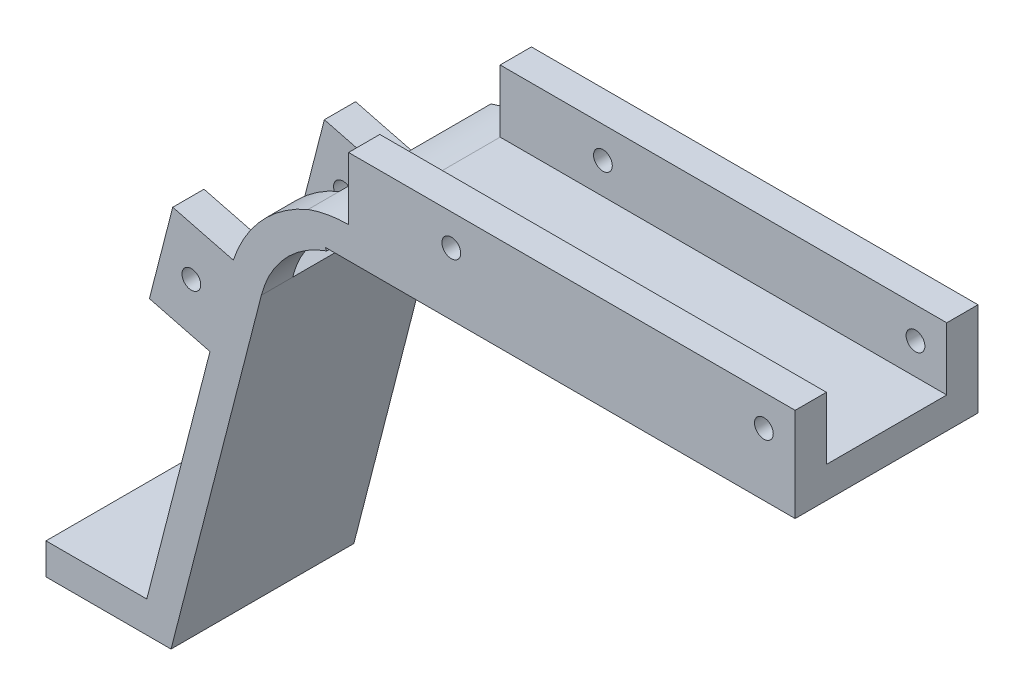
ISO-10303-21;
HEADER;
FILE_DESCRIPTION(('STEP AP214'),'2;1');
FILE_NAME('part.step','',(''),(''),'','','');
FILE_SCHEMA(('AUTOMOTIVE_DESIGN { 1 0 10303 214 1 1 1 1 }'));
ENDSEC;
DATA;
#1=APPLICATION_CONTEXT('core data for automotive mechanical design processes');
#2=APPLICATION_PROTOCOL_DEFINITION('international standard','automotive_design',2000,#1);
#3=PRODUCT_CONTEXT('',#1,'mechanical');
#4=PRODUCT('Part','Part','',(#3));
#5=PRODUCT_RELATED_PRODUCT_CATEGORY('part','',(#4));
#6=PRODUCT_DEFINITION_FORMATION('','',#4);
#7=PRODUCT_DEFINITION_CONTEXT('part definition',#1,'design');
#8=PRODUCT_DEFINITION('design','',#6,#7);
#9=PRODUCT_DEFINITION_SHAPE('','',#8);
#10=(LENGTH_UNIT() NAMED_UNIT(*) SI_UNIT(.MILLI.,.METRE.));
#11=(NAMED_UNIT(*) PLANE_ANGLE_UNIT() SI_UNIT($,.RADIAN.));
#12=(NAMED_UNIT(*) SI_UNIT($,.STERADIAN.) SOLID_ANGLE_UNIT());
#13=UNCERTAINTY_MEASURE_WITH_UNIT(LENGTH_MEASURE(1.E-05),#10,'distance_accuracy_value','');
#14=(GEOMETRIC_REPRESENTATION_CONTEXT(3) GLOBAL_UNCERTAINTY_ASSIGNED_CONTEXT((#13)) GLOBAL_UNIT_ASSIGNED_CONTEXT((#10,
#11,#12)) REPRESENTATION_CONTEXT('',''));
#15=CARTESIAN_POINT('',(0.,0.,0.));
#16=DIRECTION('',(0.,0.,1.));
#17=DIRECTION('',(1.,0.,0.));
#18=AXIS2_PLACEMENT_3D('',#15,#16,#17);
#19=CARTESIAN_POINT('',(30.0716443930858,58.6603082817505,-5.));
#20=DIRECTION('',(0.968542433750036,-0.248848455943689,0.));
#21=DIRECTION('',(0.248848455943689,0.968542433750036,0.));
#22=AXIS2_PLACEMENT_3D('',#19,#20,#21);
#23=PLANE('',#22);
#24=DIRECTION('',(0.,0.,1.));
#25=VECTOR('',#24,1.);
#26=CARTESIAN_POINT('',(26.3912089750386,44.3356950807672,-29.25));
#27=LINE('',#26,#25);
#28=CARTESIAN_POINT('',(26.3912089750386,44.3356950807672,-29.25));
#29=VERTEX_POINT('',#28);
#30=CARTESIAN_POINT('',(26.3912089750386,44.3356950807672,-24.25));
#31=VERTEX_POINT('',#30);
#32=EDGE_CURVE('E845',#29,#31,#27,.T.);
#33=ORIENTED_EDGE('',*,*,#32,.F.);
#34=DIRECTION('',(0.248848455943689,0.968542433750035,0.));
#35=VECTOR('',#34,1.);
#36=CARTESIAN_POINT('',(15.,0.,-29.25));
#37=LINE('',#36,#35);
#38=CARTESIAN_POINT('',(16.2846543799851,5.,-29.25));
#39=VERTEX_POINT('',#38);
#40=EDGE_CURVE('E235',#39,#29,#37,.T.);
#41=ORIENTED_EDGE('',*,*,#40,.F.);
#42=DIRECTION('',(0.,0.,1.));
#43=VECTOR('',#42,1.);
#44=CARTESIAN_POINT('',(16.2846543799851,5.,-5.));
#45=LINE('',#44,#43);
#46=CARTESIAN_POINT('',(16.2846543799851,5.,0.));
#47=VERTEX_POINT('',#46);
#48=EDGE_CURVE('E386',#39,#47,#45,.T.);
#49=ORIENTED_EDGE('',*,*,#48,.T.);
#50=DIRECTION('',(0.248848455943689,0.968542433750035,0.));
#51=VECTOR('',#50,1.);
#52=CARTESIAN_POINT('',(15.,0.,0.));
#53=LINE('',#52,#51);
#54=CARTESIAN_POINT('',(26.3912089750386,44.3356950807672,0.));
#55=VERTEX_POINT('',#54);
#56=EDGE_CURVE('E401',#47,#55,#53,.T.);
#57=ORIENTED_EDGE('',*,*,#56,.T.);
#58=DIRECTION('',(0.,0.,1.));
#59=VECTOR('',#58,1.);
#60=CARTESIAN_POINT('',(26.3912089750386,44.3356950807672,-5.));
#61=LINE('',#60,#59);
#62=CARTESIAN_POINT('',(26.3912089750386,44.3356950807672,-5.));
#63=VERTEX_POINT('',#62);
#64=EDGE_CURVE('E49',#63,#55,#61,.T.);
#65=ORIENTED_EDGE('',*,*,#64,.F.);
#66=DIRECTION('',(-0.248848455943689,-0.968542433750035,0.));
#67=VECTOR('',#66,1.);
#68=CARTESIAN_POINT('',(30.1238545546568,58.8635153169826,-5.));
#69=LINE('',#68,#67);
#70=CARTESIAN_POINT('',(30.1238545546567,58.8635153169826,-5.));
#71=VERTEX_POINT('',#70);
#72=EDGE_CURVE('E54',#71,#63,#69,.T.);
#73=ORIENTED_EDGE('',*,*,#72,.F.);
#74=DIRECTION('',(0.,0.,-1.));
#75=VECTOR('',#74,1.);
#76=CARTESIAN_POINT('',(30.1238545546568,58.8635153169826,-5.));
#77=LINE('',#76,#75);
#78=CARTESIAN_POINT('',(30.1238545546568,58.8635153169826,0.));
#79=VERTEX_POINT('',#78);
#80=EDGE_CURVE('E246',#79,#71,#77,.T.);
#81=ORIENTED_EDGE('',*,*,#80,.F.);
#82=CARTESIAN_POINT('',(30.1239358141939,58.8638315870177,0.));
#83=VERTEX_POINT('',#82);
#84=EDGE_CURVE('E390',#79,#83,#53,.T.);
#85=ORIENTED_EDGE('',*,*,#84,.T.);
#86=DIRECTION('',(0.,0.,1.));
#87=VECTOR('',#86,1.);
#88=CARTESIAN_POINT('',(30.1239358141939,58.8638315870177,-29.25));
#89=LINE('',#88,#87);
#90=CARTESIAN_POINT('',(30.1239358141939,58.8638315870177,-24.25));
#91=VERTEX_POINT('',#90);
#92=EDGE_CURVE('E413',#91,#83,#89,.T.);
#93=ORIENTED_EDGE('',*,*,#92,.F.);
#94=DIRECTION('',(0.248848455943689,0.968542433750036,0.));
#95=VECTOR('',#94,1.);
#96=CARTESIAN_POINT('',(30.1239358141939,58.8638315870177,-24.25));
#97=LINE('',#96,#95);
#98=EDGE_CURVE('E230',#31,#91,#97,.T.);
#99=ORIENTED_EDGE('',*,*,#98,.F.);
#100=EDGE_LOOP('',(#33,#41,#49,#57,#65,#73,#81,#85,#93,#99));
#101=FACE_BOUND('',#100,.T.);
#102=ADVANCED_FACE('F32',(#101),#23,.F.);
#103=CARTESIAN_POINT('',(120.,73.,-5.));
#104=DIRECTION('',(0.,-1.,0.));
#105=DIRECTION('',(1.,0.,0.));
#106=AXIS2_PLACEMENT_3D('',#103,#104,#105);
#107=PLANE('',#106);
#108=DIRECTION('',(1.,0.,0.));
#109=VECTOR('',#108,1.);
#110=CARTESIAN_POINT('',(48.5613886077065,73.,-24.25));
#111=LINE('',#110,#109);
#112=CARTESIAN_POINT('',(48.5613886077065,73.,-24.25));
#113=VERTEX_POINT('',#112);
#114=CARTESIAN_POINT('',(120.,73.,-24.25));
#115=VERTEX_POINT('',#114);
#116=EDGE_CURVE('E285',#113,#115,#111,.T.);
#117=ORIENTED_EDGE('',*,*,#116,.F.);
#118=DIRECTION('',(0.,0.,1.));
#119=VECTOR('',#118,1.);
#120=CARTESIAN_POINT('',(48.5613886077065,73.,-5.));
#121=LINE('',#120,#119);
#122=CARTESIAN_POINT('',(48.5613886077065,73.,-5.));
#123=VERTEX_POINT('',#122);
#124=EDGE_CURVE('E439',#113,#123,#121,.T.);
#125=ORIENTED_EDGE('',*,*,#124,.T.);
#126=DIRECTION('',(-1.,0.,0.));
#127=VECTOR('',#126,1.);
#128=CARTESIAN_POINT('',(48.5613886077065,73.,-5.));
#129=LINE('',#128,#127);
#130=CARTESIAN_POINT('',(120.,73.,-5.));
#131=VERTEX_POINT('',#130);
#132=EDGE_CURVE('E309',#131,#123,#129,.T.);
#133=ORIENTED_EDGE('',*,*,#132,.F.);
#134=DIRECTION('',(0.,0.,1.));
#135=VECTOR('',#134,1.);
#136=CARTESIAN_POINT('',(120.,73.,-5.));
#137=LINE('',#136,#135);
#138=EDGE_CURVE('E11',#115,#131,#137,.T.);
#139=ORIENTED_EDGE('',*,*,#138,.F.);
#140=EDGE_LOOP('',(#117,#125,#133,#139));
#141=FACE_BOUND('',#140,.T.);
#142=ADVANCED_FACE('F471',(#141),#107,.F.);
#143=CARTESIAN_POINT('',(44.7991427530738,68.,-29.25));
#144=DIRECTION('',(0.819152044288991,0.573576436351047,0.));
#145=DIRECTION('',(-0.573576436351047,0.819152044288991,0.));
#146=AXIS2_PLACEMENT_3D('',#143,#144,#145);
#147=PLANE('',#146);
#148=DIRECTION('',(0.573576436351047,-0.819152044288991,0.));
#149=VECTOR('',#148,1.);
#150=CARTESIAN_POINT('',(45.0696556216259,67.6136675859792,-5.));
#151=LINE('',#150,#149);
#152=CARTESIAN_POINT('',(42.0896554210916,71.8695489324633,-5.));
#153=VERTEX_POINT('',#152);
#154=CARTESIAN_POINT('',(44.7991427530738,68.,-5.));
#155=VERTEX_POINT('',#154);
#156=EDGE_CURVE('E356',#153,#155,#151,.T.);
#157=ORIENTED_EDGE('',*,*,#156,.F.);
#158=DIRECTION('',(0.,0.,1.));
#159=VECTOR('',#158,1.);
#160=CARTESIAN_POINT('',(42.0896554210916,71.8695489324633,-29.25));
#161=LINE('',#160,#159);
#162=CARTESIAN_POINT('',(42.0896554210916,71.8695489324633,-29.25));
#163=VERTEX_POINT('',#162);
#164=EDGE_CURVE('E428',#163,#153,#161,.T.);
#165=ORIENTED_EDGE('',*,*,#164,.F.);
#166=DIRECTION('',(-0.573576436351047,0.819152044288991,0.));
#167=VECTOR('',#166,1.);
#168=CARTESIAN_POINT('',(44.7991427530738,68.,-29.25));
#169=LINE('',#168,#167);
#170=CARTESIAN_POINT('',(44.7991427530738,68.,-29.25));
#171=VERTEX_POINT('',#170);
#172=EDGE_CURVE('E423',#171,#163,#169,.T.);
#173=ORIENTED_EDGE('',*,*,#172,.F.);
#174=DIRECTION('',(0.,0.,1.));
#175=VECTOR('',#174,1.);
#176=CARTESIAN_POINT('',(44.7991427530738,68.,-29.25));
#177=LINE('',#176,#175);
#178=EDGE_CURVE('E434',#171,#155,#177,.T.);
#179=ORIENTED_EDGE('',*,*,#178,.T.);
#180=EDGE_LOOP('',(#157,#165,#173,#179));
#181=FACE_BOUND('',#180,.T.);
#182=ADVANCED_FACE('F476',(#181),#147,.F.);
#183=CARTESIAN_POINT('',(34.6142500871605,56.2480223657393,-29.25));
#184=DIRECTION('',(-0.503362570604781,-0.864075299099649,0.));
#185=DIRECTION('',(0.864075299099649,-0.503362570604781,0.));
#186=AXIS2_PLACEMENT_3D('',#183,#184,#185);
#187=PLANE('',#186);
#188=DIRECTION('',(0.,0.,1.));
#189=VECTOR('',#188,1.);
#190=CARTESIAN_POINT('',(30.1249712371178,58.8632284067797,-5.));
#191=LINE('',#190,#189);
#192=CARTESIAN_POINT('',(30.1249712371178,58.8632284067797,-5.));
#193=VERTEX_POINT('',#192);
#194=CARTESIAN_POINT('',(30.1249712371178,58.8632284067797,0.));
#195=VERTEX_POINT('',#194);
#196=EDGE_CURVE('E372',#193,#195,#191,.T.);
#197=ORIENTED_EDGE('',*,*,#196,.F.);
#198=DIRECTION('',(-0.864075299099649,0.503362570604781,0.));
#199=VECTOR('',#198,1.);
#200=CARTESIAN_POINT('',(30.1249712371178,58.8632284067797,-5.));
#201=LINE('',#200,#199);
#202=CARTESIAN_POINT('',(34.6142500871605,56.2480223657393,-5.));
#203=VERTEX_POINT('',#202);
#204=EDGE_CURVE('E350',#203,#193,#201,.T.);
#205=ORIENTED_EDGE('',*,*,#204,.F.);
#206=DIRECTION('',(0.,0.,1.));
#207=VECTOR('',#206,1.);
#208=CARTESIAN_POINT('',(34.6142500871605,56.2480223657393,-29.25));
#209=LINE('',#208,#207);
#210=CARTESIAN_POINT('',(34.6142500871605,56.2480223657393,-29.25));
#211=VERTEX_POINT('',#210);
#212=EDGE_CURVE('E410',#211,#203,#209,.T.);
#213=ORIENTED_EDGE('',*,*,#212,.F.);
#214=DIRECTION('',(0.864075299099649,-0.503362570604781,0.));
#215=VECTOR('',#214,1.);
#216=CARTESIAN_POINT('',(34.6142500871605,56.2480223657393,-29.25));
#217=LINE('',#216,#215);
#218=CARTESIAN_POINT('',(30.1239358141939,58.8638315870177,-29.25));
#219=VERTEX_POINT('',#218);
#220=EDGE_CURVE('E396',#219,#211,#217,.T.);
#221=ORIENTED_EDGE('',*,*,#220,.F.);
#222=EDGE_CURVE('E414',#219,#91,#89,.T.);
#223=ORIENTED_EDGE('',*,*,#222,.T.);
#224=ORIENTED_EDGE('',*,*,#92,.T.);
#225=DIRECTION('',(0.864075299099649,-0.503362570604781,0.));
#226=VECTOR('',#225,1.);
#227=CARTESIAN_POINT('',(34.6142500871605,56.2480223657393,0.));
#228=LINE('',#227,#226);
#229=EDGE_CURVE('E403',#83,#195,#228,.T.);
#230=ORIENTED_EDGE('',*,*,#229,.T.);
#231=EDGE_LOOP('',(#197,#205,#213,#221,#223,#224,#230));
#232=FACE_BOUND('',#231,.T.);
#233=ADVANCED_FACE('F490',(#232),#187,.F.);
#234=CARTESIAN_POINT('',(0.,0.,5.));
#235=DIRECTION('',(0.,1.,0.));
#236=DIRECTION('',(0.,0.,1.));
#237=AXIS2_PLACEMENT_3D('',#234,#235,#236);
#238=PLANE('',#237);
#239=CARTESIAN_POINT('',(7.66239642763076,0.,-14.625));
#240=DIRECTION('',(0.,1.,0.));
#241=DIRECTION('',(-1.,0.,0.));
#242=AXIS2_PLACEMENT_3D('',#239,#240,#241);
#243=CIRCLE('',#242,1.5);
#244=CARTESIAN_POINT('',(6.16239642763076,0.,-14.625));
#245=VERTEX_POINT('',#244);
#246=EDGE_CURVE('E330',#245,#245,#243,.T.);
#247=ORIENTED_EDGE('',*,*,#246,.T.);
#248=EDGE_LOOP('',(#247));
#249=FACE_BOUND('',#248,.T.);
#250=DIRECTION('',(0.,0.,1.));
#251=VECTOR('',#250,1.);
#252=CARTESIAN_POINT('',(20.1623964276308,0.,-29.25));
#253=LINE('',#252,#251);
#254=CARTESIAN_POINT('',(20.1623964276308,0.,-29.25));
#255=VERTEX_POINT('',#254);
#256=CARTESIAN_POINT('',(20.1623964276307,0.,0.));
#257=VERTEX_POINT('',#256);
#258=EDGE_CURVE('E400',#255,#257,#253,.T.);
#259=ORIENTED_EDGE('',*,*,#258,.T.);
#260=DIRECTION('',(1.,0.,0.));
#261=VECTOR('',#260,1.);
#262=CARTESIAN_POINT('',(0.162396427630759,0.,0.));
#263=LINE('',#262,#261);
#264=CARTESIAN_POINT('',(0.162396427630759,0.,0.));
#265=VERTEX_POINT('',#264);
#266=EDGE_CURVE('E338',#265,#257,#263,.T.);
#267=ORIENTED_EDGE('',*,*,#266,.F.);
#268=DIRECTION('',(0.,0.,-1.));
#269=VECTOR('',#268,1.);
#270=CARTESIAN_POINT('',(0.162396427630756,0.,5.));
#271=LINE('',#270,#269);
#272=CARTESIAN_POINT('',(0.162396427630756,0.,-29.25));
#273=VERTEX_POINT('',#272);
#274=EDGE_CURVE('E383',#265,#273,#271,.T.);
#275=ORIENTED_EDGE('',*,*,#274,.T.);
#276=DIRECTION('',(-1.,0.,0.));
#277=VECTOR('',#276,1.);
#278=CARTESIAN_POINT('',(20.1623964276308,0.,-29.25));
#279=LINE('',#278,#277);
#280=EDGE_CURVE('E391',#255,#273,#279,.T.);
#281=ORIENTED_EDGE('',*,*,#280,.F.);
#282=EDGE_LOOP('',(#259,#267,#275,#281));
#283=FACE_BOUND('',#282,.T.);
#284=ADVANCED_FACE('F34',(#249,#283),#238,.F.);
#285=CARTESIAN_POINT('',(120.,0.,5.));
#286=DIRECTION('',(-1.,0.,0.));
#287=DIRECTION('',(0.,-1.,0.));
#288=AXIS2_PLACEMENT_3D('',#285,#286,#287);
#289=PLANE('',#288);
#290=DIRECTION('',(0.,-1.,0.));
#291=VECTOR('',#290,1.);
#292=CARTESIAN_POINT('',(120.,73.,-29.25));
#293=LINE('',#292,#291);
#294=CARTESIAN_POINT('',(120.,83.,-29.25));
#295=VERTEX_POINT('',#294);
#296=CARTESIAN_POINT('',(120.,68.,-29.25));
#297=VERTEX_POINT('',#296);
#298=EDGE_CURVE('E418',#295,#297,#293,.T.);
#299=ORIENTED_EDGE('',*,*,#298,.F.);
#300=DIRECTION('',(0.,0.,-1.));
#301=VECTOR('',#300,1.);
#302=CARTESIAN_POINT('',(120.,83.,-29.25));
#303=LINE('',#302,#301);
#304=CARTESIAN_POINT('',(120.,83.,-24.25));
#305=VERTEX_POINT('',#304);
#306=EDGE_CURVE('E291',#305,#295,#303,.T.);
#307=ORIENTED_EDGE('',*,*,#306,.F.);
#308=DIRECTION('',(0.,-1.,0.));
#309=VECTOR('',#308,1.);
#310=CARTESIAN_POINT('',(120.,83.,-24.25));
#311=LINE('',#310,#309);
#312=EDGE_CURVE('E299',#305,#115,#311,.T.);
#313=ORIENTED_EDGE('',*,*,#312,.T.);
#314=ORIENTED_EDGE('',*,*,#138,.T.);
#315=DIRECTION('',(0.,-1.,0.));
#316=VECTOR('',#315,1.);
#317=CARTESIAN_POINT('',(120.,83.,-5.));
#318=LINE('',#317,#316);
#319=CARTESIAN_POINT('',(120.,83.,-5.));
#320=VERTEX_POINT('',#319);
#321=EDGE_CURVE('E323',#320,#131,#318,.T.);
#322=ORIENTED_EDGE('',*,*,#321,.F.);
#323=DIRECTION('',(0.,0.,-1.));
#324=VECTOR('',#323,1.);
#325=CARTESIAN_POINT('',(120.,83.,0.));
#326=LINE('',#325,#324);
#327=CARTESIAN_POINT('',(120.,83.,0.));
#328=VERTEX_POINT('',#327);
#329=EDGE_CURVE('E312',#328,#320,#326,.T.);
#330=ORIENTED_EDGE('',*,*,#329,.F.);
#331=DIRECTION('',(0.,-1.,0.));
#332=VECTOR('',#331,1.);
#333=CARTESIAN_POINT('',(120.,0.,0.));
#334=LINE('',#333,#332);
#335=CARTESIAN_POINT('',(120.,68.,0.));
#336=VERTEX_POINT('',#335);
#337=EDGE_CURVE('E343',#328,#336,#334,.T.);
#338=ORIENTED_EDGE('',*,*,#337,.T.);
#339=DIRECTION('',(0.,0.,1.));
#340=VECTOR('',#339,1.);
#341=CARTESIAN_POINT('',(120.,68.,-29.25));
#342=LINE('',#341,#340);
#343=EDGE_CURVE('E437',#297,#336,#342,.T.);
#344=ORIENTED_EDGE('',*,*,#343,.F.);
#345=EDGE_LOOP('',(#299,#307,#313,#314,#322,#330,#338,#344));
#346=FACE_BOUND('',#345,.T.);
#347=ADVANCED_FACE('F481',(#346),#289,.F.);
#348=CARTESIAN_POINT('',(48.5613886077065,53.9097221037271,-5.));
#349=DIRECTION('',(0.,0.,1.));
#350=DIRECTION('',(1.,0.,0.));
#351=AXIS2_PLACEMENT_3D('',#348,#349,#350);
#352=CYLINDRICAL_SURFACE('',#351,19.0902778962729);
#353=DIRECTION('',(0.,0.,1.));
#354=VECTOR('',#353,1.);
#355=CARTESIAN_POINT('',(42.0896554210916,71.8695489324633,-5.));
#356=LINE('',#355,#354);
#357=CARTESIAN_POINT('',(42.0896554210916,71.8695489324633,0.));
#358=VERTEX_POINT('',#357);
#359=EDGE_CURVE('E369',#153,#358,#356,.T.);
#360=ORIENTED_EDGE('',*,*,#359,.T.);
#361=CARTESIAN_POINT('',(48.5613886077065,53.9097221037271,0.));
#362=DIRECTION('',(0.,0.,-1.));
#363=DIRECTION('',(-1.,0.,0.));
#364=AXIS2_PLACEMENT_3D('',#361,#362,#363);
#365=CIRCLE('',#364,19.0902778962729);
#366=CARTESIAN_POINT('',(48.5613886077065,73.,0.));
#367=VERTEX_POINT('',#366);
#368=EDGE_CURVE('E340',#358,#367,#365,.T.);
#369=ORIENTED_EDGE('',*,*,#368,.T.);
#370=DIRECTION('',(0.,0.,1.));
#371=VECTOR('',#370,1.);
#372=CARTESIAN_POINT('',(48.5613886077065,73.,0.));
#373=LINE('',#372,#371);
#374=EDGE_CURVE('E304',#123,#367,#373,.T.);
#375=ORIENTED_EDGE('',*,*,#374,.F.);
#376=ORIENTED_EDGE('',*,*,#124,.F.);
#377=CARTESIAN_POINT('',(48.5613886077065,73.,-29.25));
#378=VERTEX_POINT('',#377);
#379=EDGE_CURVE('E41',#378,#113,#121,.T.);
#380=ORIENTED_EDGE('',*,*,#379,.F.);
#381=CARTESIAN_POINT('',(48.5613886077065,53.9097221037271,-29.25));
#382=DIRECTION('',(0.,0.,-1.));
#383=DIRECTION('',(1.,0.,0.));
#384=AXIS2_PLACEMENT_3D('',#381,#382,#383);
#385=CIRCLE('',#384,19.0902778962729);
#386=EDGE_CURVE('E425',#163,#378,#385,.T.);
#387=ORIENTED_EDGE('',*,*,#386,.F.);
#388=ORIENTED_EDGE('',*,*,#164,.T.);
#389=EDGE_LOOP('',(#360,#369,#375,#376,#380,#387,#388));
#390=FACE_BOUND('',#389,.T.);
#391=ADVANCED_FACE('F480',(#390),#352,.T.);
#392=CARTESIAN_POINT('',(120.,68.,-29.25));
#393=DIRECTION('',(0.,1.,0.));
#394=DIRECTION('',(0.,0.,1.));
#395=AXIS2_PLACEMENT_3D('',#392,#393,#394);
#396=PLANE('',#395);
#397=DIRECTION('',(-1.,0.,0.));
#398=VECTOR('',#397,1.);
#399=CARTESIAN_POINT('',(120.,68.,0.));
#400=LINE('',#399,#398);
#401=CARTESIAN_POINT('',(44.7991427530738,68.,0.));
#402=VERTEX_POINT('',#401);
#403=EDGE_CURVE('E417',#336,#402,#400,.T.);
#404=ORIENTED_EDGE('',*,*,#403,.T.);
#405=EDGE_CURVE('E433',#155,#402,#177,.T.);
#406=ORIENTED_EDGE('',*,*,#405,.F.);
#407=ORIENTED_EDGE('',*,*,#178,.F.);
#408=DIRECTION('',(-1.,0.,0.));
#409=VECTOR('',#408,1.);
#410=CARTESIAN_POINT('',(120.,68.,-29.25));
#411=LINE('',#410,#409);
#412=EDGE_CURVE('E421',#297,#171,#411,.T.);
#413=ORIENTED_EDGE('',*,*,#412,.F.);
#414=ORIENTED_EDGE('',*,*,#343,.T.);
#415=EDGE_LOOP('',(#404,#406,#407,#413,#414));
#416=FACE_BOUND('',#415,.T.);
#417=ADVANCED_FACE('F488',(#416),#396,.F.);
#418=CARTESIAN_POINT('',(48.5613886077065,53.9097221037271,-29.25));
#419=DIRECTION('',(0.,0.,1.));
#420=DIRECTION('',(1.,0.,0.));
#421=AXIS2_PLACEMENT_3D('',#418,#419,#420);
#422=PLANE('',#421);
#423=CARTESIAN_POINT('',(65.,78.,-29.25));
#424=DIRECTION('',(0.,0.,1.));
#425=DIRECTION('',(1.,0.,0.));
#426=AXIS2_PLACEMENT_3D('',#423,#424,#425);
#427=CIRCLE('',#426,1.5);
#428=CARTESIAN_POINT('',(66.5,78.,-29.25));
#429=VERTEX_POINT('',#428);
#430=EDGE_CURVE('E266',#429,#429,#427,.T.);
#431=ORIENTED_EDGE('',*,*,#430,.T.);
#432=EDGE_LOOP('',(#431));
#433=FACE_BOUND('',#432,.T.);
#434=CARTESIAN_POINT('',(115.,78.,-29.25));
#435=DIRECTION('',(0.,0.,1.));
#436=DIRECTION('',(1.,0.,0.));
#437=AXIS2_PLACEMENT_3D('',#434,#435,#436);
#438=CIRCLE('',#437,1.5);
#439=CARTESIAN_POINT('',(116.5,78.,-29.25));
#440=VERTEX_POINT('',#439);
#441=EDGE_CURVE('E273',#440,#440,#438,.T.);
#442=ORIENTED_EDGE('',*,*,#441,.T.);
#443=EDGE_LOOP('',(#442));
#444=FACE_BOUND('',#443,.T.);
#445=ORIENTED_EDGE('',*,*,#298,.T.);
#446=ORIENTED_EDGE('',*,*,#412,.T.);
#447=ORIENTED_EDGE('',*,*,#172,.T.);
#448=ORIENTED_EDGE('',*,*,#386,.T.);
#449=DIRECTION('',(0.,-1.,0.));
#450=VECTOR('',#449,1.);
#451=CARTESIAN_POINT('',(48.5613886077065,83.,-29.25));
#452=LINE('',#451,#450);
#453=CARTESIAN_POINT('',(48.5613886077065,83.,-29.25));
#454=VERTEX_POINT('',#453);
#455=EDGE_CURVE('E296',#454,#378,#452,.T.);
#456=ORIENTED_EDGE('',*,*,#455,.F.);
#457=DIRECTION('',(-1.,0.,0.));
#458=VECTOR('',#457,1.);
#459=CARTESIAN_POINT('',(48.5613886077065,83.,-29.25));
#460=LINE('',#459,#458);
#461=EDGE_CURVE('E294',#295,#454,#460,.T.);
#462=ORIENTED_EDGE('',*,*,#461,.F.);
#463=EDGE_LOOP('',(#445,#446,#447,#448,#456,#462));
#464=FACE_BOUND('',#463,.T.);
#465=ADVANCED_FACE('F499',(#433,#444,#464),#422,.F.);
#466=CARTESIAN_POINT('',(0.,0.,0.));
#467=DIRECTION('',(0.,0.,-1.));
#468=DIRECTION('',(-1.,0.,0.));
#469=AXIS2_PLACEMENT_3D('',#466,#467,#468);
#470=PLANE('',#469);
#471=CARTESIAN_POINT('',(23.4148602258661,52.8440056136109,0.));
#472=DIRECTION('',(0.,0.,1.));
#473=DIRECTION('',(1.,0.,0.));
#474=AXIS2_PLACEMENT_3D('',#471,#472,#473);
#475=CIRCLE('',#474,1.5);
#476=CARTESIAN_POINT('',(24.9148602258661,52.8440056136109,0.));
#477=VERTEX_POINT('',#476);
#478=EDGE_CURVE('E850',#477,#477,#475,.T.);
#479=ORIENTED_EDGE('',*,*,#478,.F.);
#480=EDGE_LOOP('',(#479));
#481=FACE_BOUND('',#480,.T.);
#482=CARTESIAN_POINT('',(65.,78.,0.));
#483=DIRECTION('',(0.,0.,1.));
#484=DIRECTION('',(1.,0.,0.));
#485=AXIS2_PLACEMENT_3D('',#482,#483,#484);
#486=CIRCLE('',#485,1.5);
#487=CARTESIAN_POINT('',(66.5,78.,0.));
#488=VERTEX_POINT('',#487);
#489=EDGE_CURVE('E270',#488,#488,#486,.T.);
#490=ORIENTED_EDGE('',*,*,#489,.F.);
#491=EDGE_LOOP('',(#490));
#492=FACE_BOUND('',#491,.T.);
#493=CARTESIAN_POINT('',(115.,78.,0.));
#494=DIRECTION('',(0.,0.,1.));
#495=DIRECTION('',(1.,0.,0.));
#496=AXIS2_PLACEMENT_3D('',#493,#494,#495);
#497=CIRCLE('',#496,1.5);
#498=CARTESIAN_POINT('',(116.5,78.,0.));
#499=VERTEX_POINT('',#498);
#500=EDGE_CURVE('E265',#499,#499,#497,.T.);
#501=ORIENTED_EDGE('',*,*,#500,.F.);
#502=EDGE_LOOP('',(#501));
#503=FACE_BOUND('',#502,.T.);
#504=ORIENTED_EDGE('',*,*,#56,.F.);
#505=DIRECTION('',(-1.,0.,0.));
#506=VECTOR('',#505,1.);
#507=CARTESIAN_POINT('',(20.1623964276308,5.,0.));
#508=LINE('',#507,#506);
#509=CARTESIAN_POINT('',(0.162396427630758,5.,0.));
#510=VERTEX_POINT('',#509);
#511=EDGE_CURVE('E342',#47,#510,#508,.T.);
#512=ORIENTED_EDGE('',*,*,#511,.T.);
#513=DIRECTION('',(0.,1.,0.));
#514=VECTOR('',#513,1.);
#515=CARTESIAN_POINT('',(0.162396427630759,0.,0.));
#516=LINE('',#515,#514);
#517=EDGE_CURVE('E333',#265,#510,#516,.T.);
#518=ORIENTED_EDGE('',*,*,#517,.F.);
#519=ORIENTED_EDGE('',*,*,#266,.T.);
#520=DIRECTION('',(-0.248848455943689,-0.968542433750035,0.));
#521=VECTOR('',#520,1.);
#522=CARTESIAN_POINT('',(34.6142500871605,56.2480223657393,0.));
#523=LINE('',#522,#521);
#524=CARTESIAN_POINT('',(34.6142500871605,56.2480223657393,0.));
#525=VERTEX_POINT('',#524);
#526=EDGE_CURVE('E394',#525,#257,#523,.T.);
#527=ORIENTED_EDGE('',*,*,#526,.F.);
#528=CARTESIAN_POINT('',(50.4012958336855,52.2171674074793,0.));
#529=DIRECTION('',(0.,0.,1.));
#530=DIRECTION('',(1.,0.,0.));
#531=AXIS2_PLACEMENT_3D('',#528,#529,#530);
#532=CIRCLE('',#531,16.2935142034308);
#533=CARTESIAN_POINT('',(45.0696556216259,67.6136675859792,0.));
#534=VERTEX_POINT('',#533);
#535=EDGE_CURVE('E346',#534,#525,#532,.T.);
#536=ORIENTED_EDGE('',*,*,#535,.F.);
#537=DIRECTION('',(0.573576436351047,-0.819152044288991,0.));
#538=VECTOR('',#537,1.);
#539=CARTESIAN_POINT('',(45.0696556216259,67.6136675859792,0.));
#540=LINE('',#539,#538);
#541=EDGE_CURVE('E351',#402,#534,#540,.T.);
#542=ORIENTED_EDGE('',*,*,#541,.F.);
#543=ORIENTED_EDGE('',*,*,#403,.F.);
#544=ORIENTED_EDGE('',*,*,#337,.F.);
#545=DIRECTION('',(1.,0.,0.));
#546=VECTOR('',#545,1.);
#547=CARTESIAN_POINT('',(48.5613886077065,83.,0.));
#548=LINE('',#547,#546);
#549=CARTESIAN_POINT('',(48.5613886077065,83.,0.));
#550=VERTEX_POINT('',#549);
#551=EDGE_CURVE('E308',#550,#328,#548,.T.);
#552=ORIENTED_EDGE('',*,*,#551,.F.);
#553=DIRECTION('',(0.,-1.,0.));
#554=VECTOR('',#553,1.);
#555=CARTESIAN_POINT('',(48.5613886077065,83.,0.));
#556=LINE('',#555,#554);
#557=EDGE_CURVE('E326',#550,#367,#556,.T.);
#558=ORIENTED_EDGE('',*,*,#557,.T.);
#559=ORIENTED_EDGE('',*,*,#368,.F.);
#560=CARTESIAN_POINT('',(50.4012958336855,52.2171674074793,0.));
#561=DIRECTION('',(0.,0.,-1.));
#562=DIRECTION('',(1.,0.,0.));
#563=AXIS2_PLACEMENT_3D('',#560,#561,#562);
#564=CIRCLE('',#563,21.337747443247);
#565=EDGE_CURVE('E362',#195,#358,#564,.T.);
#566=ORIENTED_EDGE('',*,*,#565,.F.);
#567=ORIENTED_EDGE('',*,*,#229,.F.);
#568=ORIENTED_EDGE('',*,*,#84,.F.);
#569=DIRECTION('',(0.968542433750036,-0.248848455943689,0.));
#570=VECTOR('',#569,1.);
#571=CARTESIAN_POINT('',(20.4384302171564,61.3519998764195,0.));
#572=LINE('',#571,#570);
#573=CARTESIAN_POINT('',(20.4384302171564,61.3519998764195,0.));
#574=VERTEX_POINT('',#573);
#575=EDGE_CURVE('E257',#574,#79,#572,.T.);
#576=ORIENTED_EDGE('',*,*,#575,.F.);
#577=DIRECTION('',(0.248848455943689,0.968542433750035,0.));
#578=VECTOR('',#577,1.);
#579=CARTESIAN_POINT('',(20.4384302171564,61.3519998764195,0.));
#580=LINE('',#579,#578);
#581=CARTESIAN_POINT('',(16.7057846375382,46.8241796402041,0.));
#582=VERTEX_POINT('',#581);
#583=EDGE_CURVE('E248',#582,#574,#580,.T.);
#584=ORIENTED_EDGE('',*,*,#583,.F.);
#585=DIRECTION('',(0.968542433750036,-0.248848455943689,0.));
#586=VECTOR('',#585,1.);
#587=CARTESIAN_POINT('',(16.7057846375382,46.8241796402041,0.));
#588=LINE('',#587,#586);
#589=EDGE_CURVE('E260',#582,#55,#588,.T.);
#590=ORIENTED_EDGE('',*,*,#589,.T.);
#591=EDGE_LOOP('',(#504,#512,#518,#519,#527,#536,#542,#543,#544,#552,#558,#559,#566,#567,#568,
#576,#584,#590));
#592=FACE_BOUND('',#591,.T.);
#593=ADVANCED_FACE('F523',(#481,#492,#503,#592),#470,.F.);
#594=CARTESIAN_POINT('',(34.6142500871605,56.2480223657393,-29.25));
#595=DIRECTION('',(-0.968542433750035,0.248848455943689,0.));
#596=DIRECTION('',(-0.248848455943689,-0.968542433750035,0.));
#597=AXIS2_PLACEMENT_3D('',#594,#595,#596);
#598=PLANE('',#597);
#599=ORIENTED_EDGE('',*,*,#526,.T.);
#600=ORIENTED_EDGE('',*,*,#258,.F.);
#601=DIRECTION('',(-0.248848455943689,-0.968542433750035,0.));
#602=VECTOR('',#601,1.);
#603=CARTESIAN_POINT('',(34.6142500871605,56.2480223657393,-29.25));
#604=LINE('',#603,#602);
#605=EDGE_CURVE('E398',#211,#255,#604,.T.);
#606=ORIENTED_EDGE('',*,*,#605,.F.);
#607=ORIENTED_EDGE('',*,*,#212,.T.);
#608=DIRECTION('',(0.,0.,1.));
#609=VECTOR('',#608,1.);
#610=CARTESIAN_POINT('',(34.6142500871605,56.2480223657393,-5.));
#611=LINE('',#610,#609);
#612=EDGE_CURVE('E375',#203,#525,#611,.T.);
#613=ORIENTED_EDGE('',*,*,#612,.T.);
#614=EDGE_LOOP('',(#599,#600,#606,#607,#613));
#615=FACE_BOUND('',#614,.T.);
#616=ADVANCED_FACE('F573',(#615),#598,.F.);
#617=CARTESIAN_POINT('',(0.,0.,-29.25));
#618=DIRECTION('',(0.,0.,-1.));
#619=DIRECTION('',(-1.,0.,0.));
#620=AXIS2_PLACEMENT_3D('',#617,#618,#619);
#621=PLANE('',#620);
#622=CARTESIAN_POINT('',(23.4148602258661,52.8440056136109,-29.25));
#623=DIRECTION('',(0.,0.,1.));
#624=DIRECTION('',(1.,0.,0.));
#625=AXIS2_PLACEMENT_3D('',#622,#623,#624);
#626=CIRCLE('',#625,1.5);
#627=CARTESIAN_POINT('',(24.9148602258661,52.8440056136109,-29.25));
#628=VERTEX_POINT('',#627);
#629=EDGE_CURVE('E852',#628,#628,#626,.T.);
#630=ORIENTED_EDGE('',*,*,#629,.T.);
#631=EDGE_LOOP('',(#630));
#632=FACE_BOUND('',#631,.T.);
#633=ORIENTED_EDGE('',*,*,#605,.T.);
#634=ORIENTED_EDGE('',*,*,#280,.T.);
#635=DIRECTION('',(0.,1.,0.));
#636=VECTOR('',#635,1.);
#637=CARTESIAN_POINT('',(0.162396427630756,0.,-29.25));
#638=LINE('',#637,#636);
#639=CARTESIAN_POINT('',(0.162396427630756,5.,-29.25));
#640=VERTEX_POINT('',#639);
#641=EDGE_CURVE('E378',#273,#640,#638,.T.);
#642=ORIENTED_EDGE('',*,*,#641,.T.);
#643=DIRECTION('',(1.,0.,0.));
#644=VECTOR('',#643,1.);
#645=CARTESIAN_POINT('',(20.1623964276308,5.,-29.25));
#646=LINE('',#645,#644);
#647=EDGE_CURVE('E381',#640,#39,#646,.T.);
#648=ORIENTED_EDGE('',*,*,#647,.T.);
#649=ORIENTED_EDGE('',*,*,#40,.T.);
#650=DIRECTION('',(0.968542433750036,-0.248848455943689,0.));
#651=VECTOR('',#650,1.);
#652=CARTESIAN_POINT('',(16.7057846375382,46.8241796402041,-29.25));
#653=LINE('',#652,#651);
#654=CARTESIAN_POINT('',(16.7057846375382,46.8241796402041,-29.25));
#655=VERTEX_POINT('',#654);
#656=EDGE_CURVE('E215',#655,#29,#653,.T.);
#657=ORIENTED_EDGE('',*,*,#656,.F.);
#658=DIRECTION('',(-0.248848455943689,-0.968542433750036,0.));
#659=VECTOR('',#658,1.);
#660=CARTESIAN_POINT('',(20.4385114766936,61.3523161464546,-29.25));
#661=LINE('',#660,#659);
#662=CARTESIAN_POINT('',(20.4385114766936,61.3523161464546,-29.25));
#663=VERTEX_POINT('',#662);
#664=EDGE_CURVE('E222',#663,#655,#661,.T.);
#665=ORIENTED_EDGE('',*,*,#664,.F.);
#666=DIRECTION('',(0.968542433750036,-0.248848455943689,0.));
#667=VECTOR('',#666,1.);
#668=CARTESIAN_POINT('',(20.4385114766936,61.3523161464546,-29.25));
#669=LINE('',#668,#667);
#670=EDGE_CURVE('E839',#663,#219,#669,.T.);
#671=ORIENTED_EDGE('',*,*,#670,.T.);
#672=ORIENTED_EDGE('',*,*,#220,.T.);
#673=EDGE_LOOP('',(#633,#634,#642,#648,#649,#657,#665,#671,#672));
#674=FACE_BOUND('',#673,.T.);
#675=ADVANCED_FACE('F233',(#632,#674),#621,.T.);
#676=CARTESIAN_POINT('',(20.1623964276308,5.,5.));
#677=DIRECTION('',(0.,1.,0.));
#678=DIRECTION('',(0.,0.,1.));
#679=AXIS2_PLACEMENT_3D('',#676,#677,#678);
#680=PLANE('',#679);
#681=CARTESIAN_POINT('',(7.66239642763076,5.,-14.625));
#682=DIRECTION('',(0.,1.,0.));
#683=DIRECTION('',(-1.,0.,0.));
#684=AXIS2_PLACEMENT_3D('',#681,#682,#683);
#685=CIRCLE('',#684,1.5);
#686=CARTESIAN_POINT('',(6.16239642763076,5.,-14.625));
#687=VERTEX_POINT('',#686);
#688=EDGE_CURVE('E329',#687,#687,#685,.T.);
#689=ORIENTED_EDGE('',*,*,#688,.F.);
#690=EDGE_LOOP('',(#689));
#691=FACE_BOUND('',#690,.T.);
#692=ORIENTED_EDGE('',*,*,#511,.F.);
#693=ORIENTED_EDGE('',*,*,#48,.F.);
#694=ORIENTED_EDGE('',*,*,#647,.F.);
#695=DIRECTION('',(0.,0.,-1.));
#696=VECTOR('',#695,1.);
#697=CARTESIAN_POINT('',(0.162396427630756,5.,5.));
#698=LINE('',#697,#696);
#699=EDGE_CURVE('E384',#510,#640,#698,.T.);
#700=ORIENTED_EDGE('',*,*,#699,.F.);
#701=EDGE_LOOP('',(#692,#693,#694,#700));
#702=FACE_BOUND('',#701,.T.);
#703=ADVANCED_FACE('F564',(#691,#702),#680,.T.);
#704=CARTESIAN_POINT('',(0.162396427630756,0.,5.));
#705=DIRECTION('',(-1.,0.,0.));
#706=DIRECTION('',(0.,-1.,0.));
#707=AXIS2_PLACEMENT_3D('',#704,#705,#706);
#708=PLANE('',#707);
#709=ORIENTED_EDGE('',*,*,#517,.T.);
#710=ORIENTED_EDGE('',*,*,#699,.T.);
#711=ORIENTED_EDGE('',*,*,#641,.F.);
#712=ORIENTED_EDGE('',*,*,#274,.F.);
#713=EDGE_LOOP('',(#709,#710,#711,#712));
#714=FACE_BOUND('',#713,.T.);
#715=ADVANCED_FACE('F556',(#714),#708,.T.);
#716=CARTESIAN_POINT('',(45.0696556216259,67.6136675859792,-5.));
#717=DIRECTION('',(-0.819152044288991,-0.573576436351047,0.));
#718=DIRECTION('',(0.573576436351047,-0.819152044288991,0.));
#719=AXIS2_PLACEMENT_3D('',#716,#717,#718);
#720=PLANE('',#719);
#721=CARTESIAN_POINT('',(45.0696556216259,67.6136675859792,-5.));
#722=VERTEX_POINT('',#721);
#723=EDGE_CURVE('E355',#155,#722,#151,.T.);
#724=ORIENTED_EDGE('',*,*,#723,.F.);
#725=ORIENTED_EDGE('',*,*,#405,.T.);
#726=ORIENTED_EDGE('',*,*,#541,.T.);
#727=DIRECTION('',(0.,0.,1.));
#728=VECTOR('',#727,1.);
#729=CARTESIAN_POINT('',(45.0696556216259,67.6136675859792,-5.));
#730=LINE('',#729,#728);
#731=EDGE_CURVE('E359',#722,#534,#730,.T.);
#732=ORIENTED_EDGE('',*,*,#731,.F.);
#733=EDGE_LOOP('',(#724,#725,#726,#732));
#734=FACE_BOUND('',#733,.T.);
#735=ADVANCED_FACE('F552',(#734),#720,.F.);
#736=CARTESIAN_POINT('',(50.4012958336855,52.2171674074793,-5.));
#737=DIRECTION('',(0.,0.,1.));
#738=DIRECTION('',(1.,0.,0.));
#739=AXIS2_PLACEMENT_3D('',#736,#737,#738);
#740=CYLINDRICAL_SURFACE('',#739,16.2935142034308);
#741=ORIENTED_EDGE('',*,*,#535,.T.);
#742=ORIENTED_EDGE('',*,*,#612,.F.);
#743=CARTESIAN_POINT('',(50.4012958336855,52.2171674074793,-5.));
#744=DIRECTION('',(0.,0.,1.));
#745=DIRECTION('',(1.,0.,0.));
#746=AXIS2_PLACEMENT_3D('',#743,#744,#745);
#747=CIRCLE('',#746,16.2935142034308);
#748=EDGE_CURVE('E348',#722,#203,#747,.T.);
#749=ORIENTED_EDGE('',*,*,#748,.F.);
#750=ORIENTED_EDGE('',*,*,#731,.T.);
#751=EDGE_LOOP('',(#741,#742,#749,#750));
#752=FACE_BOUND('',#751,.T.);
#753=ADVANCED_FACE('F555',(#752),#740,.F.);
#754=CARTESIAN_POINT('',(50.4012958336855,52.2171674074793,-5.));
#755=DIRECTION('',(0.,0.,1.));
#756=DIRECTION('',(1.,0.,0.));
#757=AXIS2_PLACEMENT_3D('',#754,#755,#756);
#758=CYLINDRICAL_SURFACE('',#757,21.337747443247);
#759=ORIENTED_EDGE('',*,*,#565,.T.);
#760=ORIENTED_EDGE('',*,*,#359,.F.);
#761=CARTESIAN_POINT('',(50.4012958336855,52.2171674074793,-5.));
#762=DIRECTION('',(0.,0.,-1.));
#763=DIRECTION('',(1.,0.,0.));
#764=AXIS2_PLACEMENT_3D('',#761,#762,#763);
#765=CIRCLE('',#764,21.337747443247);
#766=EDGE_CURVE('E353',#193,#153,#765,.T.);
#767=ORIENTED_EDGE('',*,*,#766,.F.);
#768=ORIENTED_EDGE('',*,*,#196,.T.);
#769=EDGE_LOOP('',(#759,#760,#767,#768));
#770=FACE_BOUND('',#769,.T.);
#771=ADVANCED_FACE('F550',(#770),#758,.T.);
#772=CARTESIAN_POINT('',(50.4012958336855,52.2171674074793,-5.));
#773=DIRECTION('',(0.,0.,1.));
#774=DIRECTION('',(1.,0.,0.));
#775=AXIS2_PLACEMENT_3D('',#772,#773,#774);
#776=PLANE('',#775);
#777=ORIENTED_EDGE('',*,*,#748,.T.);
#778=ORIENTED_EDGE('',*,*,#204,.T.);
#779=ORIENTED_EDGE('',*,*,#766,.T.);
#780=ORIENTED_EDGE('',*,*,#156,.T.);
#781=ORIENTED_EDGE('',*,*,#723,.T.);
#782=EDGE_LOOP('',(#777,#778,#779,#780,#781));
#783=FACE_BOUND('',#782,.T.);
#784=ADVANCED_FACE('F543',(#783),#776,.F.);
#785=CARTESIAN_POINT('',(7.66239642763076,0.,-14.625));
#786=DIRECTION('',(0.,1.,0.));
#787=DIRECTION('',(-1.,0.,0.));
#788=AXIS2_PLACEMENT_3D('',#785,#786,#787);
#789=CYLINDRICAL_SURFACE('',#788,1.5);
#790=ORIENTED_EDGE('',*,*,#246,.F.);
#791=EDGE_LOOP('',(#790));
#792=FACE_BOUND('',#791,.T.);
#793=ORIENTED_EDGE('',*,*,#688,.T.);
#794=EDGE_LOOP('',(#793));
#795=FACE_BOUND('',#794,.T.);
#796=ADVANCED_FACE('F535',(#792,#795),#789,.F.);
#797=CARTESIAN_POINT('',(48.5613886077065,83.,0.));
#798=DIRECTION('',(1.,0.,0.));
#799=DIRECTION('',(0.,1.,0.));
#800=AXIS2_PLACEMENT_3D('',#797,#798,#799);
#801=PLANE('',#800);
#802=ORIENTED_EDGE('',*,*,#374,.T.);
#803=ORIENTED_EDGE('',*,*,#557,.F.);
#804=DIRECTION('',(0.,0.,1.));
#805=VECTOR('',#804,1.);
#806=CARTESIAN_POINT('',(48.5613886077065,83.,0.));
#807=LINE('',#806,#805);
#808=CARTESIAN_POINT('',(48.5613886077065,83.,-5.));
#809=VERTEX_POINT('',#808);
#810=EDGE_CURVE('E305',#809,#550,#807,.T.);
#811=ORIENTED_EDGE('',*,*,#810,.F.);
#812=DIRECTION('',(0.,-1.,0.));
#813=VECTOR('',#812,1.);
#814=CARTESIAN_POINT('',(48.5613886077065,83.,-5.));
#815=LINE('',#814,#813);
#816=EDGE_CURVE('E316',#809,#123,#815,.T.);
#817=ORIENTED_EDGE('',*,*,#816,.T.);
#818=EDGE_LOOP('',(#802,#803,#811,#817));
#819=FACE_BOUND('',#818,.T.);
#820=ADVANCED_FACE('F533',(#819),#801,.F.);
#821=CARTESIAN_POINT('',(48.5613886077065,83.,-5.));
#822=DIRECTION('',(0.,0.,1.));
#823=DIRECTION('',(1.,0.,0.));
#824=AXIS2_PLACEMENT_3D('',#821,#822,#823);
#825=PLANE('',#824);
#826=CARTESIAN_POINT('',(65.,78.,-5.));
#827=DIRECTION('',(0.,0.,1.));
#828=DIRECTION('',(1.,0.,0.));
#829=AXIS2_PLACEMENT_3D('',#826,#827,#828);
#830=CIRCLE('',#829,1.5);
#831=CARTESIAN_POINT('',(66.5,78.,-5.));
#832=VERTEX_POINT('',#831);
#833=EDGE_CURVE('E282',#832,#832,#830,.T.);
#834=ORIENTED_EDGE('',*,*,#833,.T.);
#835=EDGE_LOOP('',(#834));
#836=FACE_BOUND('',#835,.T.);
#837=CARTESIAN_POINT('',(115.,78.,-5.));
#838=DIRECTION('',(0.,0.,1.));
#839=DIRECTION('',(1.,0.,0.));
#840=AXIS2_PLACEMENT_3D('',#837,#838,#839);
#841=CIRCLE('',#840,1.5);
#842=CARTESIAN_POINT('',(116.5,78.,-5.));
#843=VERTEX_POINT('',#842);
#844=EDGE_CURVE('E278',#843,#843,#841,.T.);
#845=ORIENTED_EDGE('',*,*,#844,.T.);
#846=EDGE_LOOP('',(#845));
#847=FACE_BOUND('',#846,.T.);
#848=ORIENTED_EDGE('',*,*,#132,.T.);
#849=ORIENTED_EDGE('',*,*,#816,.F.);
#850=DIRECTION('',(-1.,0.,0.));
#851=VECTOR('',#850,1.);
#852=CARTESIAN_POINT('',(48.5613886077065,83.,-5.));
#853=LINE('',#852,#851);
#854=EDGE_CURVE('E314',#320,#809,#853,.T.);
#855=ORIENTED_EDGE('',*,*,#854,.F.);
#856=ORIENTED_EDGE('',*,*,#321,.T.);
#857=EDGE_LOOP('',(#848,#849,#855,#856));
#858=FACE_BOUND('',#857,.T.);
#859=ADVANCED_FACE('F516',(#836,#847,#858),#825,.F.);
#860=CARTESIAN_POINT('',(0.,83.,0.));
#861=DIRECTION('',(0.,-1.,0.));
#862=DIRECTION('',(1.,0.,0.));
#863=AXIS2_PLACEMENT_3D('',#860,#861,#862);
#864=PLANE('',#863);
#865=ORIENTED_EDGE('',*,*,#810,.T.);
#866=ORIENTED_EDGE('',*,*,#551,.T.);
#867=ORIENTED_EDGE('',*,*,#329,.T.);
#868=ORIENTED_EDGE('',*,*,#854,.T.);
#869=EDGE_LOOP('',(#865,#866,#867,#868));
#870=FACE_BOUND('',#869,.T.);
#871=ADVANCED_FACE('F519',(#870),#864,.F.);
#872=CARTESIAN_POINT('',(48.5613886077065,83.,-29.25));
#873=DIRECTION('',(1.,0.,0.));
#874=DIRECTION('',(0.,1.,0.));
#875=AXIS2_PLACEMENT_3D('',#872,#873,#874);
#876=PLANE('',#875);
#877=ORIENTED_EDGE('',*,*,#379,.T.);
#878=DIRECTION('',(0.,-1.,0.));
#879=VECTOR('',#878,1.);
#880=CARTESIAN_POINT('',(48.5613886077065,83.,-24.25));
#881=LINE('',#880,#879);
#882=CARTESIAN_POINT('',(48.5613886077065,83.,-24.25));
#883=VERTEX_POINT('',#882);
#884=EDGE_CURVE('E302',#883,#113,#881,.T.);
#885=ORIENTED_EDGE('',*,*,#884,.F.);
#886=DIRECTION('',(0.,0.,1.));
#887=VECTOR('',#886,1.);
#888=CARTESIAN_POINT('',(48.5613886077065,83.,-29.25));
#889=LINE('',#888,#887);
#890=EDGE_CURVE('E286',#454,#883,#889,.T.);
#891=ORIENTED_EDGE('',*,*,#890,.F.);
#892=ORIENTED_EDGE('',*,*,#455,.T.);
#893=EDGE_LOOP('',(#877,#885,#891,#892));
#894=FACE_BOUND('',#893,.T.);
#895=ADVANCED_FACE('F505',(#894),#876,.F.);
#896=CARTESIAN_POINT('',(48.5613886077065,83.,-24.25));
#897=DIRECTION('',(0.,0.,-1.));
#898=DIRECTION('',(-1.,0.,0.));
#899=AXIS2_PLACEMENT_3D('',#896,#897,#898);
#900=PLANE('',#899);
#901=CARTESIAN_POINT('',(65.,78.,-24.25));
#902=DIRECTION('',(0.,0.,-1.));
#903=DIRECTION('',(-1.,0.,0.));
#904=AXIS2_PLACEMENT_3D('',#901,#902,#903);
#905=CIRCLE('',#904,1.5);
#906=CARTESIAN_POINT('',(63.5,78.,-24.25));
#907=VERTEX_POINT('',#906);
#908=EDGE_CURVE('E281',#907,#907,#905,.T.);
#909=ORIENTED_EDGE('',*,*,#908,.T.);
#910=EDGE_LOOP('',(#909));
#911=FACE_BOUND('',#910,.T.);
#912=CARTESIAN_POINT('',(115.,78.,-24.25));
#913=DIRECTION('',(0.,0.,-1.));
#914=DIRECTION('',(-1.,0.,0.));
#915=AXIS2_PLACEMENT_3D('',#912,#913,#914);
#916=CIRCLE('',#915,1.5);
#917=CARTESIAN_POINT('',(113.5,78.,-24.25));
#918=VERTEX_POINT('',#917);
#919=EDGE_CURVE('E269',#918,#918,#916,.T.);
#920=ORIENTED_EDGE('',*,*,#919,.T.);
#921=EDGE_LOOP('',(#920));
#922=FACE_BOUND('',#921,.T.);
#923=ORIENTED_EDGE('',*,*,#116,.T.);
#924=ORIENTED_EDGE('',*,*,#312,.F.);
#925=DIRECTION('',(1.,0.,0.));
#926=VECTOR('',#925,1.);
#927=CARTESIAN_POINT('',(48.5613886077065,83.,-24.25));
#928=LINE('',#927,#926);
#929=EDGE_CURVE('E289',#883,#305,#928,.T.);
#930=ORIENTED_EDGE('',*,*,#929,.F.);
#931=ORIENTED_EDGE('',*,*,#884,.T.);
#932=EDGE_LOOP('',(#923,#924,#930,#931));
#933=FACE_BOUND('',#932,.T.);
#934=ADVANCED_FACE('F447',(#911,#922,#933),#900,.F.);
#935=CARTESIAN_POINT('',(0.,83.,0.));
#936=DIRECTION('',(0.,1.,0.));
#937=DIRECTION('',(-1.,0.,0.));
#938=AXIS2_PLACEMENT_3D('',#935,#936,#937);
#939=PLANE('',#938);
#940=ORIENTED_EDGE('',*,*,#890,.T.);
#941=ORIENTED_EDGE('',*,*,#929,.T.);
#942=ORIENTED_EDGE('',*,*,#306,.T.);
#943=ORIENTED_EDGE('',*,*,#461,.T.);
#944=EDGE_LOOP('',(#940,#941,#942,#943));
#945=FACE_BOUND('',#944,.T.);
#946=ADVANCED_FACE('F463',(#945),#939,.T.);
#947=CARTESIAN_POINT('',(115.,78.,-29.25));
#948=DIRECTION('',(0.,0.,1.));
#949=DIRECTION('',(1.,0.,0.));
#950=AXIS2_PLACEMENT_3D('',#947,#948,#949);
#951=CYLINDRICAL_SURFACE('',#950,1.5);
#952=ORIENTED_EDGE('',*,*,#441,.F.);
#953=EDGE_LOOP('',(#952));
#954=FACE_BOUND('',#953,.T.);
#955=ORIENTED_EDGE('',*,*,#919,.F.);
#956=EDGE_LOOP('',(#955));
#957=FACE_BOUND('',#956,.T.);
#958=ADVANCED_FACE('F453',(#954,#957),#951,.F.);
#959=CARTESIAN_POINT('',(65.,78.,-29.25));
#960=DIRECTION('',(0.,0.,1.));
#961=DIRECTION('',(1.,0.,0.));
#962=AXIS2_PLACEMENT_3D('',#959,#960,#961);
#963=CYLINDRICAL_SURFACE('',#962,1.5);
#964=ORIENTED_EDGE('',*,*,#430,.F.);
#965=EDGE_LOOP('',(#964));
#966=FACE_BOUND('',#965,.T.);
#967=ORIENTED_EDGE('',*,*,#908,.F.);
#968=EDGE_LOOP('',(#967));
#969=FACE_BOUND('',#968,.T.);
#970=ADVANCED_FACE('F450',(#966,#969),#963,.F.);
#971=ORIENTED_EDGE('',*,*,#500,.T.);
#972=EDGE_LOOP('',(#971));
#973=FACE_BOUND('',#972,.T.);
#974=ORIENTED_EDGE('',*,*,#844,.F.);
#975=EDGE_LOOP('',(#974));
#976=FACE_BOUND('',#975,.T.);
#977=ADVANCED_FACE('F452',(#973,#976),#951,.F.);
#978=ORIENTED_EDGE('',*,*,#489,.T.);
#979=EDGE_LOOP('',(#978));
#980=FACE_BOUND('',#979,.T.);
#981=ORIENTED_EDGE('',*,*,#833,.F.);
#982=EDGE_LOOP('',(#981));
#983=FACE_BOUND('',#982,.T.);
#984=ADVANCED_FACE('F456',(#980,#983),#963,.F.);
#985=CARTESIAN_POINT('',(20.4384302171564,61.3519998764195,-5.));
#986=DIRECTION('',(0.,0.,1.));
#987=DIRECTION('',(0.,-1.,0.));
#988=AXIS2_PLACEMENT_3D('',#985,#986,#987);
#989=PLANE('',#988);
#990=CARTESIAN_POINT('',(23.4148602258661,52.8440056136109,-5.));
#991=DIRECTION('',(0.,0.,1.));
#992=DIRECTION('',(0.,-1.,0.));
#993=AXIS2_PLACEMENT_3D('',#990,#991,#992);
#994=CIRCLE('',#993,1.5);
#995=CARTESIAN_POINT('',(23.4148602258661,51.3440056136109,-5.));
#996=VERTEX_POINT('',#995);
#997=EDGE_CURVE('E823',#996,#996,#994,.T.);
#998=ORIENTED_EDGE('',*,*,#997,.T.);
#999=EDGE_LOOP('',(#998));
#1000=FACE_BOUND('',#999,.T.);
#1001=ORIENTED_EDGE('',*,*,#72,.T.);
#1002=DIRECTION('',(0.968542433750036,-0.248848455943689,0.));
#1003=VECTOR('',#1002,1.);
#1004=CARTESIAN_POINT('',(16.7057846375382,46.8241796402041,-5.));
#1005=LINE('',#1004,#1003);
#1006=CARTESIAN_POINT('',(16.7057846375382,46.8241796402041,-5.));
#1007=VERTEX_POINT('',#1006);
#1008=EDGE_CURVE('E263',#1007,#63,#1005,.T.);
#1009=ORIENTED_EDGE('',*,*,#1008,.F.);
#1010=DIRECTION('',(-0.248848455943689,-0.968542433750035,0.));
#1011=VECTOR('',#1010,1.);
#1012=CARTESIAN_POINT('',(20.4384302171564,61.3519998764195,-5.));
#1013=LINE('',#1012,#1011);
#1014=CARTESIAN_POINT('',(20.4384302171564,61.3519998764195,-5.));
#1015=VERTEX_POINT('',#1014);
#1016=EDGE_CURVE('E242',#1015,#1007,#1013,.T.);
#1017=ORIENTED_EDGE('',*,*,#1016,.F.);
#1018=DIRECTION('',(0.968542433750036,-0.248848455943689,0.));
#1019=VECTOR('',#1018,1.);
#1020=CARTESIAN_POINT('',(20.4384302171564,61.3519998764195,-5.));
#1021=LINE('',#1020,#1019);
#1022=EDGE_CURVE('E251',#1015,#71,#1021,.T.);
#1023=ORIENTED_EDGE('',*,*,#1022,.T.);
#1024=EDGE_LOOP('',(#1001,#1009,#1017,#1023));
#1025=FACE_BOUND('',#1024,.T.);
#1026=ADVANCED_FACE('F468',(#1000,#1025),#989,.F.);
#1027=CARTESIAN_POINT('',(16.7057846375382,46.8241796402041,-5.));
#1028=DIRECTION('',(0.248848455943689,0.968542433750036,0.));
#1029=DIRECTION('',(-0.968542433750036,0.248848455943689,0.));
#1030=AXIS2_PLACEMENT_3D('',#1027,#1028,#1029);
#1031=PLANE('',#1030);
#1032=ORIENTED_EDGE('',*,*,#64,.T.);
#1033=ORIENTED_EDGE('',*,*,#589,.F.);
#1034=DIRECTION('',(0.,0.,1.));
#1035=VECTOR('',#1034,1.);
#1036=CARTESIAN_POINT('',(16.7057846375382,46.8241796402041,-5.));
#1037=LINE('',#1036,#1035);
#1038=EDGE_CURVE('E245',#1007,#582,#1037,.T.);
#1039=ORIENTED_EDGE('',*,*,#1038,.F.);
#1040=ORIENTED_EDGE('',*,*,#1008,.T.);
#1041=EDGE_LOOP('',(#1032,#1033,#1039,#1040));
#1042=FACE_BOUND('',#1041,.T.);
#1043=ADVANCED_FACE('F736',(#1042),#1031,.F.);
#1044=CARTESIAN_POINT('',(20.4384302171564,61.3519998764195,-5.));
#1045=DIRECTION('',(-0.248848455943689,-0.968542433750036,0.));
#1046=DIRECTION('',(0.968542433750036,-0.248848455943689,0.));
#1047=AXIS2_PLACEMENT_3D('',#1044,#1045,#1046);
#1048=PLANE('',#1047);
#1049=ORIENTED_EDGE('',*,*,#80,.T.);
#1050=ORIENTED_EDGE('',*,*,#1022,.F.);
#1051=DIRECTION('',(0.,0.,-1.));
#1052=VECTOR('',#1051,1.);
#1053=CARTESIAN_POINT('',(20.4384302171564,61.3519998764195,-5.));
#1054=LINE('',#1053,#1052);
#1055=EDGE_CURVE('E250',#574,#1015,#1054,.T.);
#1056=ORIENTED_EDGE('',*,*,#1055,.F.);
#1057=ORIENTED_EDGE('',*,*,#575,.T.);
#1058=EDGE_LOOP('',(#1049,#1050,#1056,#1057));
#1059=FACE_BOUND('',#1058,.T.);
#1060=ADVANCED_FACE('F741',(#1059),#1048,.F.);
#1061=CARTESIAN_POINT('',(4.38569235211629,-1.1268197778827,0.));
#1062=DIRECTION('',(-0.968542433750036,0.248848455943689,0.));
#1063=DIRECTION('',(-0.248848455943689,-0.968542433750035,0.));
#1064=AXIS2_PLACEMENT_3D('',#1061,#1062,#1063);
#1065=PLANE('',#1064);
#1066=ORIENTED_EDGE('',*,*,#1016,.T.);
#1067=ORIENTED_EDGE('',*,*,#1038,.T.);
#1068=ORIENTED_EDGE('',*,*,#583,.T.);
#1069=ORIENTED_EDGE('',*,*,#1055,.T.);
#1070=EDGE_LOOP('',(#1066,#1067,#1068,#1069));
#1071=FACE_BOUND('',#1070,.T.);
#1072=ADVANCED_FACE('F752',(#1071),#1065,.T.);
#1073=CARTESIAN_POINT('',(16.7057846375382,46.8241796402041,-29.25));
#1074=DIRECTION('',(0.248848455943689,0.968542433750036,0.));
#1075=DIRECTION('',(-0.968542433750036,0.248848455943689,0.));
#1076=AXIS2_PLACEMENT_3D('',#1073,#1074,#1075);
#1077=PLANE('',#1076);
#1078=ORIENTED_EDGE('',*,*,#32,.T.);
#1079=DIRECTION('',(0.968542433750036,-0.248848455943689,0.));
#1080=VECTOR('',#1079,1.);
#1081=CARTESIAN_POINT('',(16.7057846375382,46.8241796402041,-24.25));
#1082=LINE('',#1081,#1080);
#1083=CARTESIAN_POINT('',(16.7057846375382,46.8241796402041,-24.25));
#1084=VERTEX_POINT('',#1083);
#1085=EDGE_CURVE('E218',#1084,#31,#1082,.T.);
#1086=ORIENTED_EDGE('',*,*,#1085,.F.);
#1087=DIRECTION('',(0.,0.,1.));
#1088=VECTOR('',#1087,1.);
#1089=CARTESIAN_POINT('',(16.7057846375382,46.8241796402041,-29.25));
#1090=LINE('',#1089,#1088);
#1091=EDGE_CURVE('E211',#655,#1084,#1090,.T.);
#1092=ORIENTED_EDGE('',*,*,#1091,.F.);
#1093=ORIENTED_EDGE('',*,*,#656,.T.);
#1094=EDGE_LOOP('',(#1078,#1086,#1092,#1093));
#1095=FACE_BOUND('',#1094,.T.);
#1096=ADVANCED_FACE('F213',(#1095),#1077,.F.);
#1097=CARTESIAN_POINT('',(20.4385114766936,61.3523161464546,-24.25));
#1098=DIRECTION('',(0.,0.,-1.));
#1099=DIRECTION('',(-1.,0.,0.));
#1100=AXIS2_PLACEMENT_3D('',#1097,#1098,#1099);
#1101=PLANE('',#1100);
#1102=CARTESIAN_POINT('',(23.4148602258661,52.8440056136109,-24.25));
#1103=DIRECTION('',(0.,0.,-1.));
#1104=DIRECTION('',(-1.,0.,0.));
#1105=AXIS2_PLACEMENT_3D('',#1102,#1103,#1104);
#1106=CIRCLE('',#1105,1.5);
#1107=CARTESIAN_POINT('',(21.9148602258661,52.8440056136109,-24.25));
#1108=VERTEX_POINT('',#1107);
#1109=EDGE_CURVE('E36',#1108,#1108,#1106,.T.);
#1110=ORIENTED_EDGE('',*,*,#1109,.T.);
#1111=EDGE_LOOP('',(#1110));
#1112=FACE_BOUND('',#1111,.T.);
#1113=ORIENTED_EDGE('',*,*,#98,.T.);
#1114=DIRECTION('',(0.968542433750036,-0.248848455943689,0.));
#1115=VECTOR('',#1114,1.);
#1116=CARTESIAN_POINT('',(20.4385114766936,61.3523161464546,-24.25));
#1117=LINE('',#1116,#1115);
#1118=CARTESIAN_POINT('',(20.4385114766936,61.3523161464546,-24.25));
#1119=VERTEX_POINT('',#1118);
#1120=EDGE_CURVE('E238',#1119,#91,#1117,.T.);
#1121=ORIENTED_EDGE('',*,*,#1120,.F.);
#1122=DIRECTION('',(0.248848455943689,0.968542433750036,0.));
#1123=VECTOR('',#1122,1.);
#1124=CARTESIAN_POINT('',(20.4385114766936,61.3523161464546,-24.25));
#1125=LINE('',#1124,#1123);
#1126=EDGE_CURVE('E221',#1084,#1119,#1125,.T.);
#1127=ORIENTED_EDGE('',*,*,#1126,.F.);
#1128=ORIENTED_EDGE('',*,*,#1085,.T.);
#1129=EDGE_LOOP('',(#1113,#1121,#1127,#1128));
#1130=FACE_BOUND('',#1129,.T.);
#1131=ADVANCED_FACE('F771',(#1112,#1130),#1101,.F.);
#1132=CARTESIAN_POINT('',(20.4385114766936,61.3523161464546,-29.25));
#1133=DIRECTION('',(-0.248848455943689,-0.968542433750036,0.));
#1134=DIRECTION('',(0.968542433750036,-0.248848455943689,0.));
#1135=AXIS2_PLACEMENT_3D('',#1132,#1133,#1134);
#1136=PLANE('',#1135);
#1137=ORIENTED_EDGE('',*,*,#222,.F.);
#1138=ORIENTED_EDGE('',*,*,#670,.F.);
#1139=DIRECTION('',(0.,0.,-1.));
#1140=VECTOR('',#1139,1.);
#1141=CARTESIAN_POINT('',(20.4385114766936,61.3523161464546,-29.25));
#1142=LINE('',#1141,#1140);
#1143=EDGE_CURVE('E227',#1119,#663,#1142,.T.);
#1144=ORIENTED_EDGE('',*,*,#1143,.F.);
#1145=ORIENTED_EDGE('',*,*,#1120,.T.);
#1146=EDGE_LOOP('',(#1137,#1138,#1144,#1145));
#1147=FACE_BOUND('',#1146,.T.);
#1148=ADVANCED_FACE('F778',(#1147),#1136,.F.);
#1149=CARTESIAN_POINT('',(4.38569235211629,-1.1268197778827,0.));
#1150=DIRECTION('',(-0.968542433750036,0.248848455943689,0.));
#1151=DIRECTION('',(-0.248848455943689,-0.968542433750036,0.));
#1152=AXIS2_PLACEMENT_3D('',#1149,#1150,#1151);
#1153=PLANE('',#1152);
#1154=ORIENTED_EDGE('',*,*,#664,.T.);
#1155=ORIENTED_EDGE('',*,*,#1091,.T.);
#1156=ORIENTED_EDGE('',*,*,#1126,.T.);
#1157=ORIENTED_EDGE('',*,*,#1143,.T.);
#1158=EDGE_LOOP('',(#1154,#1155,#1156,#1157));
#1159=FACE_BOUND('',#1158,.T.);
#1160=ADVANCED_FACE('F225',(#1159),#1153,.T.);
#1161=CARTESIAN_POINT('',(23.4148602258661,52.8440056136109,-29.25));
#1162=DIRECTION('',(0.,0.,1.));
#1163=DIRECTION('',(1.,0.,0.));
#1164=AXIS2_PLACEMENT_3D('',#1161,#1162,#1163);
#1165=CYLINDRICAL_SURFACE('',#1164,1.5);
#1166=ORIENTED_EDGE('',*,*,#629,.F.);
#1167=EDGE_LOOP('',(#1166));
#1168=FACE_BOUND('',#1167,.T.);
#1169=ORIENTED_EDGE('',*,*,#1109,.F.);
#1170=EDGE_LOOP('',(#1169));
#1171=FACE_BOUND('',#1170,.T.);
#1172=ADVANCED_FACE('F790',(#1168,#1171),#1165,.F.);
#1173=ORIENTED_EDGE('',*,*,#478,.T.);
#1174=EDGE_LOOP('',(#1173));
#1175=FACE_BOUND('',#1174,.T.);
#1176=ORIENTED_EDGE('',*,*,#997,.F.);
#1177=EDGE_LOOP('',(#1176));
#1178=FACE_BOUND('',#1177,.T.);
#1179=ADVANCED_FACE('F800',(#1175,#1178),#1165,.F.);
#1180=CLOSED_SHELL('',(#102,#142,#182,#233,#284,#347,#391,#417,#465,#593,#616,#675,#703,#715,
#735,#753,#771,#784,#796,#820,#859,#871,#895,#934,#946,#958,#970,#977,#984,#1026,#1043,#1060,
#1072,#1096,#1131,#1148,#1160,#1172,#1179));
#1181=MANIFOLD_SOLID_BREP('B2',#1180);
#1182=ADVANCED_BREP_SHAPE_REPRESENTATION('',(#18,#1181),#14);
#1183=SHAPE_DEFINITION_REPRESENTATION(#9,#1182);
ENDSEC;
END-ISO-10303-21;
